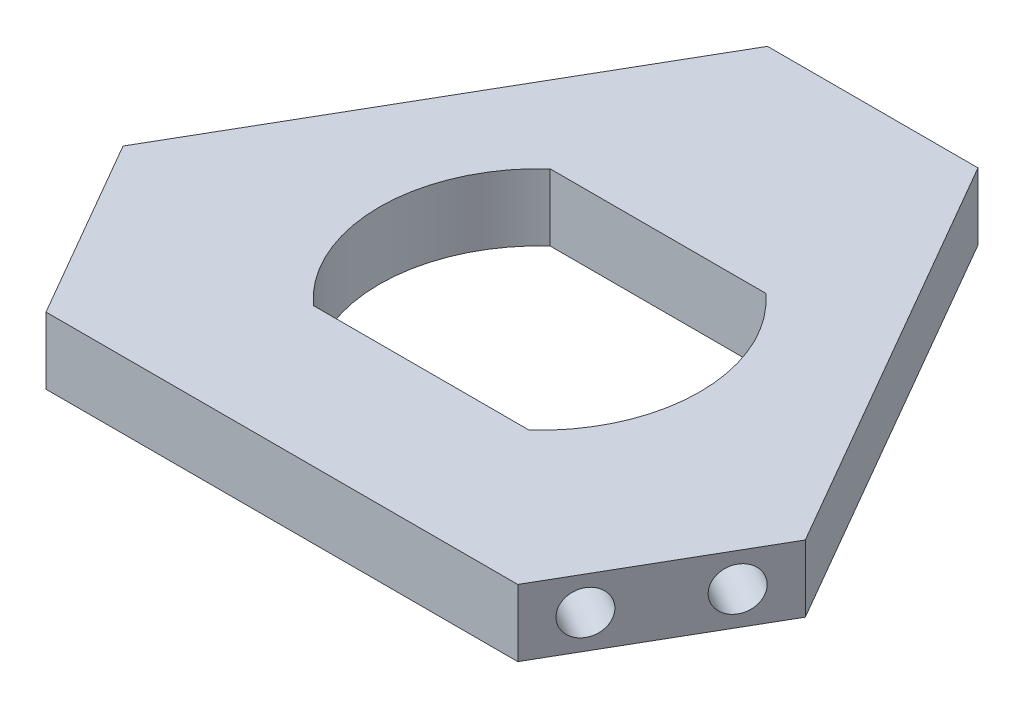
ISO-10303-21;
HEADER;
FILE_DESCRIPTION(('STEP AP214'),'2;1');
FILE_NAME('part.step','',(''),(''),'','','');
FILE_SCHEMA(('AUTOMOTIVE_DESIGN { 1 0 10303 214 1 1 1 1 }'));
ENDSEC;
DATA;
#1=APPLICATION_CONTEXT('core data for automotive mechanical design processes');
#2=APPLICATION_PROTOCOL_DEFINITION('international standard','automotive_design',2000,#1);
#3=PRODUCT_CONTEXT('',#1,'mechanical');
#4=PRODUCT('Part','Part','',(#3));
#5=PRODUCT_RELATED_PRODUCT_CATEGORY('part','',(#4));
#6=PRODUCT_DEFINITION_FORMATION('','',#4);
#7=PRODUCT_DEFINITION_CONTEXT('part definition',#1,'design');
#8=PRODUCT_DEFINITION('design','',#6,#7);
#9=PRODUCT_DEFINITION_SHAPE('','',#8);
#10=(LENGTH_UNIT() NAMED_UNIT(*) SI_UNIT(.MILLI.,.METRE.));
#11=(NAMED_UNIT(*) PLANE_ANGLE_UNIT() SI_UNIT($,.RADIAN.));
#12=(NAMED_UNIT(*) SI_UNIT($,.STERADIAN.) SOLID_ANGLE_UNIT());
#13=UNCERTAINTY_MEASURE_WITH_UNIT(LENGTH_MEASURE(1.E-05),#10,'distance_accuracy_value','');
#14=(GEOMETRIC_REPRESENTATION_CONTEXT(3) GLOBAL_UNCERTAINTY_ASSIGNED_CONTEXT((#13)) GLOBAL_UNIT_ASSIGNED_CONTEXT((#10,
#11,#12)) REPRESENTATION_CONTEXT('',''));
#15=CARTESIAN_POINT('',(0.,0.,0.));
#16=DIRECTION('',(0.,0.,1.));
#17=DIRECTION('',(1.,0.,0.));
#18=AXIS2_PLACEMENT_3D('',#15,#16,#17);
#19=CARTESIAN_POINT('',(0.,12.,0.));
#20=DIRECTION('',(0.,1.,0.));
#21=DIRECTION('',(0.,0.,1.));
#22=AXIS2_PLACEMENT_3D('',#19,#20,#21);
#23=PLANE('',#22);
#24=DIRECTION('',(-0.5,0.,-0.866025403784439));
#25=VECTOR('',#24,1.);
#26=CARTESIAN_POINT('',(61.2205985041123,12.,13.5371870788978));
#27=LINE('',#26,#25);
#28=CARTESIAN_POINT('',(61.2205985041123,12.,13.5371870788978));
#29=VERTEX_POINT('',#28);
#30=CARTESIAN_POINT('',(18.8867513459482,12.,-59.7871870788977));
#31=VERTEX_POINT('',#30);
#32=EDGE_CURVE('E157',#29,#31,#27,.T.);
#33=ORIENTED_EDGE('',*,*,#32,.T.);
#34=DIRECTION('',(-1.,0.,0.));
#35=VECTOR('',#34,1.);
#36=CARTESIAN_POINT('',(18.8867513459482,12.,-59.7871870788977));
#37=LINE('',#36,#35);
#38=CARTESIAN_POINT('',(-18.8867513459483,12.,-59.7871870788977));
#39=VERTEX_POINT('',#38);
#40=EDGE_CURVE('E145',#31,#39,#37,.T.);
#41=ORIENTED_EDGE('',*,*,#40,.T.);
#42=DIRECTION('',(-0.5,0.,0.866025403784439));
#43=VECTOR('',#42,1.);
#44=CARTESIAN_POINT('',(-18.8867513459483,12.,-59.7871870788977));
#45=LINE('',#44,#43);
#46=CARTESIAN_POINT('',(-61.2205985041123,12.,13.5371870788977));
#47=VERTEX_POINT('',#46);
#48=EDGE_CURVE('E148',#39,#47,#45,.T.);
#49=ORIENTED_EDGE('',*,*,#48,.T.);
#50=DIRECTION('',(0.499999999999997,0.,0.86602540378444));
#51=VECTOR('',#50,1.);
#52=CARTESIAN_POINT('',(-61.2205985041123,12.,13.5371870788977));
#53=LINE('',#52,#51);
#54=CARTESIAN_POINT('',(-42.3338471581642,12.,46.25));
#55=VERTEX_POINT('',#54);
#56=EDGE_CURVE('E151',#47,#55,#53,.T.);
#57=ORIENTED_EDGE('',*,*,#56,.T.);
#58=DIRECTION('',(1.,0.,0.));
#59=VECTOR('',#58,1.);
#60=CARTESIAN_POINT('',(-42.3338471581642,12.,46.25));
#61=LINE('',#60,#59);
#62=CARTESIAN_POINT('',(42.3338471581641,12.,46.25));
#63=VERTEX_POINT('',#62);
#64=EDGE_CURVE('E153',#55,#63,#61,.T.);
#65=ORIENTED_EDGE('',*,*,#64,.T.);
#66=DIRECTION('',(0.5,0.,-0.866025403784439));
#67=VECTOR('',#66,1.);
#68=CARTESIAN_POINT('',(42.3338471581641,12.,46.25));
#69=LINE('',#68,#67);
#70=EDGE_CURVE('E155',#63,#29,#69,.T.);
#71=ORIENTED_EDGE('',*,*,#70,.T.);
#72=EDGE_LOOP('',(#33,#41,#49,#57,#65,#71));
#73=FACE_BOUND('',#72,.T.);
#74=DIRECTION('',(1.,0.,0.));
#75=VECTOR('',#74,1.);
#76=CARTESIAN_POINT('',(-28.75,12.,21.25));
#77=LINE('',#76,#75);
#78=CARTESIAN_POINT('',(-19.3649167310371,12.,21.25));
#79=VERTEX_POINT('',#78);
#80=CARTESIAN_POINT('',(19.3649167310371,12.,21.25));
#81=VERTEX_POINT('',#80);
#82=EDGE_CURVE('E114',#79,#81,#77,.T.);
#83=ORIENTED_EDGE('',*,*,#82,.F.);
#84=CARTESIAN_POINT('',(0.,12.,0.));
#85=DIRECTION('',(0.,1.,0.));
#86=DIRECTION('',(0.,0.,1.));
#87=AXIS2_PLACEMENT_3D('',#84,#85,#86);
#88=CIRCLE('',#87,28.75);
#89=CARTESIAN_POINT('',(-19.3649167310371,12.,-21.25));
#90=VERTEX_POINT('',#89);
#91=EDGE_CURVE('E127',#90,#79,#88,.T.);
#92=ORIENTED_EDGE('',*,*,#91,.F.);
#93=DIRECTION('',(-1.,0.,0.));
#94=VECTOR('',#93,1.);
#95=CARTESIAN_POINT('',(-28.75,12.,-21.25));
#96=LINE('',#95,#94);
#97=CARTESIAN_POINT('',(19.3649167310371,12.,-21.25));
#98=VERTEX_POINT('',#97);
#99=EDGE_CURVE('E50',#98,#90,#96,.T.);
#100=ORIENTED_EDGE('',*,*,#99,.F.);
#101=EDGE_CURVE('E57',#81,#98,#88,.T.);
#102=ORIENTED_EDGE('',*,*,#101,.F.);
#103=EDGE_LOOP('',(#83,#92,#100,#102));
#104=FACE_BOUND('',#103,.T.);
#105=ADVANCED_FACE('F35',(#73,#104),#23,.T.);
#106=CARTESIAN_POINT('',(0.,0.,0.));
#107=DIRECTION('',(0.,1.,0.));
#108=DIRECTION('',(0.,0.,1.));
#109=AXIS2_PLACEMENT_3D('',#106,#107,#108);
#110=PLANE('',#109);
#111=DIRECTION('',(0.5,0.,-0.866025403784439));
#112=VECTOR('',#111,1.);
#113=CARTESIAN_POINT('',(42.3338471581641,0.,46.25));
#114=LINE('',#113,#112);
#115=CARTESIAN_POINT('',(42.3338471581641,0.,46.25));
#116=VERTEX_POINT('',#115);
#117=CARTESIAN_POINT('',(61.2205985041123,0.,13.5371870788978));
#118=VERTEX_POINT('',#117);
#119=EDGE_CURVE('E168',#116,#118,#114,.T.);
#120=ORIENTED_EDGE('',*,*,#119,.F.);
#121=DIRECTION('',(1.,0.,0.));
#122=VECTOR('',#121,1.);
#123=CARTESIAN_POINT('',(-42.3338471581642,0.,46.25));
#124=LINE('',#123,#122);
#125=CARTESIAN_POINT('',(-42.3338471581642,0.,46.25));
#126=VERTEX_POINT('',#125);
#127=EDGE_CURVE('E166',#126,#116,#124,.T.);
#128=ORIENTED_EDGE('',*,*,#127,.F.);
#129=DIRECTION('',(0.499999999999997,0.,0.86602540378444));
#130=VECTOR('',#129,1.);
#131=CARTESIAN_POINT('',(-61.2205985041123,0.,13.5371870788977));
#132=LINE('',#131,#130);
#133=CARTESIAN_POINT('',(-61.2205985041123,0.,13.5371870788977));
#134=VERTEX_POINT('',#133);
#135=EDGE_CURVE('E164',#134,#126,#132,.T.);
#136=ORIENTED_EDGE('',*,*,#135,.F.);
#137=DIRECTION('',(-0.5,0.,0.866025403784439));
#138=VECTOR('',#137,1.);
#139=CARTESIAN_POINT('',(-18.8867513459483,0.,-59.7871870788977));
#140=LINE('',#139,#138);
#141=CARTESIAN_POINT('',(-18.8867513459483,0.,-59.7871870788977));
#142=VERTEX_POINT('',#141);
#143=EDGE_CURVE('E162',#142,#134,#140,.T.);
#144=ORIENTED_EDGE('',*,*,#143,.F.);
#145=DIRECTION('',(-1.,0.,0.));
#146=VECTOR('',#145,1.);
#147=CARTESIAN_POINT('',(18.8867513459482,0.,-59.7871870788977));
#148=LINE('',#147,#146);
#149=CARTESIAN_POINT('',(18.8867513459482,0.,-59.7871870788977));
#150=VERTEX_POINT('',#149);
#151=EDGE_CURVE('E121',#150,#142,#148,.T.);
#152=ORIENTED_EDGE('',*,*,#151,.F.);
#153=DIRECTION('',(-0.5,0.,-0.866025403784439));
#154=VECTOR('',#153,1.);
#155=CARTESIAN_POINT('',(61.2205985041123,0.,13.5371870788978));
#156=LINE('',#155,#154);
#157=EDGE_CURVE('E149',#118,#150,#156,.T.);
#158=ORIENTED_EDGE('',*,*,#157,.F.);
#159=EDGE_LOOP('',(#120,#128,#136,#144,#152,#158));
#160=FACE_BOUND('',#159,.T.);
#161=DIRECTION('',(1.,0.,0.));
#162=VECTOR('',#161,1.);
#163=CARTESIAN_POINT('',(-28.75,0.,21.25));
#164=LINE('',#163,#162);
#165=CARTESIAN_POINT('',(-19.3649167310371,0.,21.25));
#166=VERTEX_POINT('',#165);
#167=CARTESIAN_POINT('',(19.3649167310371,0.,21.25));
#168=VERTEX_POINT('',#167);
#169=EDGE_CURVE('E140',#166,#168,#164,.T.);
#170=ORIENTED_EDGE('',*,*,#169,.T.);
#171=CARTESIAN_POINT('',(0.,0.,0.));
#172=DIRECTION('',(0.,1.,0.));
#173=DIRECTION('',(0.,0.,1.));
#174=AXIS2_PLACEMENT_3D('',#171,#172,#173);
#175=CIRCLE('',#174,28.75);
#176=CARTESIAN_POINT('',(19.3649167310371,0.,-21.25));
#177=VERTEX_POINT('',#176);
#178=EDGE_CURVE('E125',#168,#177,#175,.T.);
#179=ORIENTED_EDGE('',*,*,#178,.T.);
#180=DIRECTION('',(-1.,0.,0.));
#181=VECTOR('',#180,1.);
#182=CARTESIAN_POINT('',(-28.75,0.,-21.25));
#183=LINE('',#182,#181);
#184=CARTESIAN_POINT('',(-19.3649167310371,0.,-21.25));
#185=VERTEX_POINT('',#184);
#186=EDGE_CURVE('E139',#177,#185,#183,.T.);
#187=ORIENTED_EDGE('',*,*,#186,.T.);
#188=EDGE_CURVE('E135',#185,#166,#175,.T.);
#189=ORIENTED_EDGE('',*,*,#188,.T.);
#190=EDGE_LOOP('',(#170,#179,#187,#189));
#191=FACE_BOUND('',#190,.T.);
#192=ADVANCED_FACE('F192',(#160,#191),#110,.F.);
#193=CARTESIAN_POINT('',(18.8867513459482,12.,-59.7871870788977));
#194=DIRECTION('',(0.,0.,1.));
#195=DIRECTION('',(1.,0.,0.));
#196=AXIS2_PLACEMENT_3D('',#193,#194,#195);
#197=PLANE('',#196);
#198=CARTESIAN_POINT('',(9.9999999999997,6.,-59.7871870788978));
#199=DIRECTION('',(0.,0.,-1.));
#200=DIRECTION('',(-1.,0.,0.));
#201=AXIS2_PLACEMENT_3D('',#198,#199,#200);
#202=CIRCLE('',#201,3.875);
#203=CARTESIAN_POINT('',(6.12499999999971,6.,-59.7871870788978));
#204=VERTEX_POINT('',#203);
#205=EDGE_CURVE('E444',#204,#204,#202,.T.);
#206=ORIENTED_EDGE('',*,*,#205,.F.);
#207=EDGE_LOOP('',(#206));
#208=FACE_BOUND('',#207,.T.);
#209=CARTESIAN_POINT('',(-10.0000000000003,6.,-59.7871870788977));
#210=DIRECTION('',(0.,0.,-1.));
#211=DIRECTION('',(-1.,0.,0.));
#212=AXIS2_PLACEMENT_3D('',#209,#210,#211);
#213=CIRCLE('',#212,3.875);
#214=CARTESIAN_POINT('',(-13.8750000000003,6.,-59.7871870788977));
#215=VERTEX_POINT('',#214);
#216=EDGE_CURVE('E454',#215,#215,#213,.T.);
#217=ORIENTED_EDGE('',*,*,#216,.F.);
#218=EDGE_LOOP('',(#217));
#219=FACE_BOUND('',#218,.T.);
#220=ORIENTED_EDGE('',*,*,#151,.T.);
#221=DIRECTION('',(0.,-1.,0.));
#222=VECTOR('',#221,1.);
#223=CARTESIAN_POINT('',(-18.8867513459483,12.,-59.7871870788977));
#224=LINE('',#223,#222);
#225=EDGE_CURVE('E185',#39,#142,#224,.T.);
#226=ORIENTED_EDGE('',*,*,#225,.F.);
#227=ORIENTED_EDGE('',*,*,#40,.F.);
#228=DIRECTION('',(0.,-1.,0.));
#229=VECTOR('',#228,1.);
#230=CARTESIAN_POINT('',(18.8867513459482,12.,-59.7871870788977));
#231=LINE('',#230,#229);
#232=EDGE_CURVE('E159',#31,#150,#231,.T.);
#233=ORIENTED_EDGE('',*,*,#232,.T.);
#234=EDGE_LOOP('',(#220,#226,#227,#233));
#235=FACE_BOUND('',#234,.T.);
#236=ADVANCED_FACE('F37',(#208,#219,#235),#197,.F.);
#237=CARTESIAN_POINT('',(-18.8867513459483,12.,-59.7871870788977));
#238=DIRECTION('',(0.866025403784439,0.,0.5));
#239=DIRECTION('',(0.5,0.,-0.866025403784439));
#240=AXIS2_PLACEMENT_3D('',#237,#238,#239);
#241=PLANE('',#240);
#242=ORIENTED_EDGE('',*,*,#143,.T.);
#243=DIRECTION('',(0.,-1.,0.));
#244=VECTOR('',#243,1.);
#245=CARTESIAN_POINT('',(-61.2205985041123,12.,13.5371870788977));
#246=LINE('',#245,#244);
#247=EDGE_CURVE('E182',#47,#134,#246,.T.);
#248=ORIENTED_EDGE('',*,*,#247,.F.);
#249=ORIENTED_EDGE('',*,*,#48,.F.);
#250=ORIENTED_EDGE('',*,*,#225,.T.);
#251=EDGE_LOOP('',(#242,#248,#249,#250));
#252=FACE_BOUND('',#251,.T.);
#253=ADVANCED_FACE('F201',(#252),#241,.F.);
#254=CARTESIAN_POINT('',(-61.2205985041123,12.,13.5371870788977));
#255=DIRECTION('',(0.86602540378444,0.,-0.499999999999997));
#256=DIRECTION('',(-0.499999999999997,0.,-0.86602540378444));
#257=AXIS2_PLACEMENT_3D('',#254,#255,#256);
#258=PLANE('',#257);
#259=CARTESIAN_POINT('',(-56.777222831138,6.,21.233339501605));
#260=DIRECTION('',(-0.866025403784434,0.,0.500000000000008));
#261=DIRECTION('',(0.500000000000008,0.,0.866025403784434));
#262=AXIS2_PLACEMENT_3D('',#259,#260,#261);
#263=CIRCLE('',#262,3.875);
#264=CARTESIAN_POINT('',(-54.839722831138,6.,24.5891879412697));
#265=VERTEX_POINT('',#264);
#266=EDGE_CURVE('E460',#265,#265,#263,.T.);
#267=ORIENTED_EDGE('',*,*,#266,.F.);
#268=EDGE_LOOP('',(#267));
#269=FACE_BOUND('',#268,.T.);
#270=CARTESIAN_POINT('',(-46.7772228311378,6.,38.5538475772937));
#271=DIRECTION('',(-0.866025403784434,0.,0.500000000000008));
#272=DIRECTION('',(0.500000000000008,0.,0.866025403784434));
#273=AXIS2_PLACEMENT_3D('',#270,#271,#272);
#274=CIRCLE('',#273,3.875);
#275=CARTESIAN_POINT('',(-44.8397228311378,6.,41.9096960169584));
#276=VERTEX_POINT('',#275);
#277=EDGE_CURVE('E466',#276,#276,#274,.T.);
#278=ORIENTED_EDGE('',*,*,#277,.F.);
#279=EDGE_LOOP('',(#278));
#280=FACE_BOUND('',#279,.T.);
#281=ORIENTED_EDGE('',*,*,#135,.T.);
#282=DIRECTION('',(0.,-1.,0.));
#283=VECTOR('',#282,1.);
#284=CARTESIAN_POINT('',(-42.3338471581642,12.,46.25));
#285=LINE('',#284,#283);
#286=EDGE_CURVE('E179',#55,#126,#285,.T.);
#287=ORIENTED_EDGE('',*,*,#286,.F.);
#288=ORIENTED_EDGE('',*,*,#56,.F.);
#289=ORIENTED_EDGE('',*,*,#247,.T.);
#290=EDGE_LOOP('',(#281,#287,#288,#289));
#291=FACE_BOUND('',#290,.T.);
#292=ADVANCED_FACE('F219',(#269,#280,#291),#258,.F.);
#293=CARTESIAN_POINT('',(-42.3338471581642,12.,46.25));
#294=DIRECTION('',(0.,0.,-1.));
#295=DIRECTION('',(-1.,0.,0.));
#296=AXIS2_PLACEMENT_3D('',#293,#294,#295);
#297=PLANE('',#296);
#298=ORIENTED_EDGE('',*,*,#127,.T.);
#299=DIRECTION('',(0.,-1.,0.));
#300=VECTOR('',#299,1.);
#301=CARTESIAN_POINT('',(42.3338471581641,12.,46.25));
#302=LINE('',#301,#300);
#303=EDGE_CURVE('E176',#63,#116,#302,.T.);
#304=ORIENTED_EDGE('',*,*,#303,.F.);
#305=ORIENTED_EDGE('',*,*,#64,.F.);
#306=ORIENTED_EDGE('',*,*,#286,.T.);
#307=EDGE_LOOP('',(#298,#304,#305,#306));
#308=FACE_BOUND('',#307,.T.);
#309=ADVANCED_FACE('F215',(#308),#297,.F.);
#310=CARTESIAN_POINT('',(42.3338471581641,12.,46.25));
#311=DIRECTION('',(-0.866025403784439,0.,-0.5));
#312=DIRECTION('',(-0.5,0.,0.866025403784439));
#313=AXIS2_PLACEMENT_3D('',#310,#311,#312);
#314=PLANE('',#313);
#315=CARTESIAN_POINT('',(46.7772228311382,6.,38.5538475772932));
#316=DIRECTION('',(0.866025403784439,0.,0.5));
#317=DIRECTION('',(0.5,0.,-0.866025403784439));
#318=AXIS2_PLACEMENT_3D('',#315,#316,#317);
#319=CIRCLE('',#318,3.875);
#320=CARTESIAN_POINT('',(48.7147228311382,6.,35.1979991376285));
#321=VERTEX_POINT('',#320);
#322=EDGE_CURVE('E471',#321,#321,#319,.T.);
#323=ORIENTED_EDGE('',*,*,#322,.F.);
#324=EDGE_LOOP('',(#323));
#325=FACE_BOUND('',#324,.T.);
#326=CARTESIAN_POINT('',(56.7772228311382,6.,21.2333395016045));
#327=DIRECTION('',(0.866025403784439,0.,0.5));
#328=DIRECTION('',(0.5,0.,-0.866025403784439));
#329=AXIS2_PLACEMENT_3D('',#326,#327,#328);
#330=CIRCLE('',#329,3.875);
#331=CARTESIAN_POINT('',(58.7147228311382,6.,17.8774910619398));
#332=VERTEX_POINT('',#331);
#333=EDGE_CURVE('E133',#332,#332,#330,.T.);
#334=ORIENTED_EDGE('',*,*,#333,.F.);
#335=EDGE_LOOP('',(#334));
#336=FACE_BOUND('',#335,.T.);
#337=ORIENTED_EDGE('',*,*,#119,.T.);
#338=DIRECTION('',(0.,-1.,0.));
#339=VECTOR('',#338,1.);
#340=CARTESIAN_POINT('',(61.2205985041123,12.,13.5371870788978));
#341=LINE('',#340,#339);
#342=EDGE_CURVE('E173',#29,#118,#341,.T.);
#343=ORIENTED_EDGE('',*,*,#342,.F.);
#344=ORIENTED_EDGE('',*,*,#70,.F.);
#345=ORIENTED_EDGE('',*,*,#303,.T.);
#346=EDGE_LOOP('',(#337,#343,#344,#345));
#347=FACE_BOUND('',#346,.T.);
#348=ADVANCED_FACE('F211',(#325,#336,#347),#314,.F.);
#349=CARTESIAN_POINT('',(61.2205985041123,12.,13.5371870788978));
#350=DIRECTION('',(-0.866025403784438,0.,0.5));
#351=DIRECTION('',(0.5,0.,0.866025403784439));
#352=AXIS2_PLACEMENT_3D('',#349,#350,#351);
#353=PLANE('',#352);
#354=ORIENTED_EDGE('',*,*,#157,.T.);
#355=ORIENTED_EDGE('',*,*,#232,.F.);
#356=ORIENTED_EDGE('',*,*,#32,.F.);
#357=ORIENTED_EDGE('',*,*,#342,.T.);
#358=EDGE_LOOP('',(#354,#355,#356,#357));
#359=FACE_BOUND('',#358,.T.);
#360=ADVANCED_FACE('F208',(#359),#353,.F.);
#361=CARTESIAN_POINT('',(-28.75,12.,-21.25));
#362=DIRECTION('',(0.,0.,1.));
#363=DIRECTION('',(1.,0.,0.));
#364=AXIS2_PLACEMENT_3D('',#361,#362,#363);
#365=PLANE('',#364);
#366=DIRECTION('',(0.,-1.,0.));
#367=VECTOR('',#366,1.);
#368=CARTESIAN_POINT('',(-19.3649167310371,12.,-21.25));
#369=LINE('',#368,#367);
#370=EDGE_CURVE('E129',#185,#90,#369,.F.);
#371=ORIENTED_EDGE('',*,*,#370,.F.);
#372=ORIENTED_EDGE('',*,*,#186,.F.);
#373=DIRECTION('',(0.,-1.,0.));
#374=VECTOR('',#373,1.);
#375=CARTESIAN_POINT('',(19.3649167310371,12.,-21.25));
#376=LINE('',#375,#374);
#377=EDGE_CURVE('E126',#98,#177,#376,.T.);
#378=ORIENTED_EDGE('',*,*,#377,.F.);
#379=ORIENTED_EDGE('',*,*,#99,.T.);
#380=EDGE_LOOP('',(#371,#372,#378,#379));
#381=FACE_BOUND('',#380,.T.);
#382=ADVANCED_FACE('F190',(#381),#365,.T.);
#383=CARTESIAN_POINT('',(-28.75,12.,21.25));
#384=DIRECTION('',(0.,0.,-1.));
#385=DIRECTION('',(-1.,0.,0.));
#386=AXIS2_PLACEMENT_3D('',#383,#384,#385);
#387=PLANE('',#386);
#388=DIRECTION('',(0.,-1.,0.));
#389=VECTOR('',#388,1.);
#390=CARTESIAN_POINT('',(19.3649167310371,12.,21.25));
#391=LINE('',#390,#389);
#392=EDGE_CURVE('E11',#168,#81,#391,.F.);
#393=ORIENTED_EDGE('',*,*,#392,.F.);
#394=ORIENTED_EDGE('',*,*,#169,.F.);
#395=DIRECTION('',(0.,-1.,0.));
#396=VECTOR('',#395,1.);
#397=CARTESIAN_POINT('',(-19.3649167310371,12.,21.25));
#398=LINE('',#397,#396);
#399=EDGE_CURVE('E43',#79,#166,#398,.T.);
#400=ORIENTED_EDGE('',*,*,#399,.F.);
#401=ORIENTED_EDGE('',*,*,#82,.T.);
#402=EDGE_LOOP('',(#393,#394,#400,#401));
#403=FACE_BOUND('',#402,.T.);
#404=ADVANCED_FACE('F115',(#403),#387,.T.);
#405=CARTESIAN_POINT('',(0.,12.,0.));
#406=DIRECTION('',(0.,-1.,0.));
#407=DIRECTION('',(0.,0.,-1.));
#408=AXIS2_PLACEMENT_3D('',#405,#406,#407);
#409=CYLINDRICAL_SURFACE('',#408,28.75);
#410=ORIENTED_EDGE('',*,*,#188,.F.);
#411=ORIENTED_EDGE('',*,*,#370,.T.);
#412=ORIENTED_EDGE('',*,*,#91,.T.);
#413=ORIENTED_EDGE('',*,*,#399,.T.);
#414=EDGE_LOOP('',(#410,#411,#412,#413));
#415=FACE_BOUND('',#414,.T.);
#416=ADVANCED_FACE('F189',(#415),#409,.F.);
#417=ORIENTED_EDGE('',*,*,#101,.T.);
#418=ORIENTED_EDGE('',*,*,#377,.T.);
#419=ORIENTED_EDGE('',*,*,#178,.F.);
#420=ORIENTED_EDGE('',*,*,#392,.T.);
#421=EDGE_LOOP('',(#417,#418,#419,#420));
#422=FACE_BOUND('',#421,.T.);
#423=ADVANCED_FACE('F123',(#422),#409,.F.);
#424=CARTESIAN_POINT('',(48.1169687932938,6.,16.2333395016045));
#425=DIRECTION('',(0.866025403784439,0.,0.5));
#426=DIRECTION('',(0.5,0.,-0.866025403784439));
#427=AXIS2_PLACEMENT_3D('',#424,#425,#426);
#428=CYLINDRICAL_SURFACE('',#427,3.875);
#429=CARTESIAN_POINT('',(48.1169687932938,6.,16.2333395016045));
#430=DIRECTION('',(0.866025403784439,0.,0.5));
#431=DIRECTION('',(0.5,0.,-0.866025403784439));
#432=AXIS2_PLACEMENT_3D('',#429,#430,#431);
#433=CIRCLE('',#432,3.875);
#434=CARTESIAN_POINT('',(50.0544687932938,6.,12.8774910619398));
#435=VERTEX_POINT('',#434);
#436=EDGE_CURVE('E447',#435,#435,#433,.T.);
#437=ORIENTED_EDGE('',*,*,#436,.F.);
#438=EDGE_LOOP('',(#437));
#439=FACE_BOUND('',#438,.T.);
#440=ORIENTED_EDGE('',*,*,#333,.T.);
#441=EDGE_LOOP('',(#440));
#442=FACE_BOUND('',#441,.T.);
#443=ADVANCED_FACE('F292',(#439,#442),#428,.F.);
#444=CARTESIAN_POINT('',(48.1169687932938,6.,16.2333395016045));
#445=DIRECTION('',(0.866025403784439,0.,0.5));
#446=DIRECTION('',(0.5,0.,-0.866025403784439));
#447=AXIS2_PLACEMENT_3D('',#444,#445,#446);
#448=PLANE('',#447);
#449=ORIENTED_EDGE('',*,*,#436,.T.);
#450=EDGE_LOOP('',(#449));
#451=FACE_BOUND('',#450,.T.);
#452=ADVANCED_FACE('F297',(#451),#448,.T.);
#453=CARTESIAN_POINT('',(38.1169687932938,6.,33.5538475772932));
#454=DIRECTION('',(0.866025403784439,0.,0.5));
#455=DIRECTION('',(0.5,0.,-0.866025403784439));
#456=AXIS2_PLACEMENT_3D('',#453,#454,#455);
#457=CYLINDRICAL_SURFACE('',#456,3.875);
#458=CARTESIAN_POINT('',(38.1169687932938,6.,33.5538475772932));
#459=DIRECTION('',(0.866025403784439,0.,0.5));
#460=DIRECTION('',(0.5,0.,-0.866025403784439));
#461=AXIS2_PLACEMENT_3D('',#458,#459,#460);
#462=CIRCLE('',#461,3.875);
#463=CARTESIAN_POINT('',(40.0544687932938,6.,30.1979991376285));
#464=VERTEX_POINT('',#463);
#465=EDGE_CURVE('E136',#464,#464,#462,.T.);
#466=ORIENTED_EDGE('',*,*,#465,.F.);
#467=EDGE_LOOP('',(#466));
#468=FACE_BOUND('',#467,.T.);
#469=ORIENTED_EDGE('',*,*,#322,.T.);
#470=EDGE_LOOP('',(#469));
#471=FACE_BOUND('',#470,.T.);
#472=ADVANCED_FACE('F305',(#468,#471),#457,.F.);
#473=CARTESIAN_POINT('',(38.1169687932938,6.,33.5538475772932));
#474=DIRECTION('',(0.866025403784439,0.,0.5));
#475=DIRECTION('',(0.5,0.,-0.866025403784439));
#476=AXIS2_PLACEMENT_3D('',#473,#474,#475);
#477=PLANE('',#476);
#478=ORIENTED_EDGE('',*,*,#465,.T.);
#479=EDGE_LOOP('',(#478));
#480=FACE_BOUND('',#479,.T.);
#481=ADVANCED_FACE('F313',(#480),#477,.T.);
#482=CARTESIAN_POINT('',(-38.1169687932935,6.,33.5538475772936));
#483=DIRECTION('',(-0.866025403784434,0.,0.500000000000008));
#484=DIRECTION('',(0.500000000000008,0.,0.866025403784434));
#485=AXIS2_PLACEMENT_3D('',#482,#483,#484);
#486=CYLINDRICAL_SURFACE('',#485,3.875);
#487=CARTESIAN_POINT('',(-38.1169687932935,6.,33.5538475772936));
#488=DIRECTION('',(-0.866025403784434,0.,0.500000000000008));
#489=DIRECTION('',(0.500000000000008,0.,0.866025403784434));
#490=AXIS2_PLACEMENT_3D('',#487,#488,#489);
#491=CIRCLE('',#490,3.875);
#492=CARTESIAN_POINT('',(-36.1794687932935,6.,36.9096960169583));
#493=VERTEX_POINT('',#492);
#494=EDGE_CURVE('E463',#493,#493,#491,.T.);
#495=ORIENTED_EDGE('',*,*,#494,.F.);
#496=EDGE_LOOP('',(#495));
#497=FACE_BOUND('',#496,.T.);
#498=ORIENTED_EDGE('',*,*,#277,.T.);
#499=EDGE_LOOP('',(#498));
#500=FACE_BOUND('',#499,.T.);
#501=ADVANCED_FACE('F321',(#497,#500),#486,.F.);
#502=CARTESIAN_POINT('',(-38.1169687932935,6.,33.5538475772936));
#503=DIRECTION('',(-0.866025403784434,0.,0.500000000000008));
#504=DIRECTION('',(0.500000000000008,0.,0.866025403784434));
#505=AXIS2_PLACEMENT_3D('',#502,#503,#504);
#506=PLANE('',#505);
#507=ORIENTED_EDGE('',*,*,#494,.T.);
#508=EDGE_LOOP('',(#507));
#509=FACE_BOUND('',#508,.T.);
#510=ADVANCED_FACE('F328',(#509),#506,.T.);
#511=CARTESIAN_POINT('',(-48.1169687932937,6.,16.233339501605));
#512=DIRECTION('',(-0.866025403784434,0.,0.500000000000008));
#513=DIRECTION('',(0.500000000000008,0.,0.866025403784434));
#514=AXIS2_PLACEMENT_3D('',#511,#512,#513);
#515=CYLINDRICAL_SURFACE('',#514,3.875);
#516=CARTESIAN_POINT('',(-48.1169687932937,6.,16.233339501605));
#517=DIRECTION('',(-0.866025403784434,0.,0.500000000000008));
#518=DIRECTION('',(0.500000000000008,0.,0.866025403784434));
#519=AXIS2_PLACEMENT_3D('',#516,#517,#518);
#520=CIRCLE('',#519,3.875);
#521=CARTESIAN_POINT('',(-46.1794687932936,6.,19.5891879412696));
#522=VERTEX_POINT('',#521);
#523=EDGE_CURVE('E457',#522,#522,#520,.T.);
#524=ORIENTED_EDGE('',*,*,#523,.F.);
#525=EDGE_LOOP('',(#524));
#526=FACE_BOUND('',#525,.T.);
#527=ORIENTED_EDGE('',*,*,#266,.T.);
#528=EDGE_LOOP('',(#527));
#529=FACE_BOUND('',#528,.T.);
#530=ADVANCED_FACE('F336',(#526,#529),#515,.F.);
#531=CARTESIAN_POINT('',(-48.1169687932937,6.,16.233339501605));
#532=DIRECTION('',(-0.866025403784434,0.,0.500000000000008));
#533=DIRECTION('',(0.500000000000008,0.,0.866025403784434));
#534=AXIS2_PLACEMENT_3D('',#531,#532,#533);
#535=PLANE('',#534);
#536=ORIENTED_EDGE('',*,*,#523,.T.);
#537=EDGE_LOOP('',(#536));
#538=FACE_BOUND('',#537,.T.);
#539=ADVANCED_FACE('F344',(#538),#535,.T.);
#540=CARTESIAN_POINT('',(-10.0000000000002,6.,-49.7871870788977));
#541=DIRECTION('',(0.,0.,-1.));
#542=DIRECTION('',(-1.,0.,0.));
#543=AXIS2_PLACEMENT_3D('',#540,#541,#542);
#544=CYLINDRICAL_SURFACE('',#543,3.875);
#545=CARTESIAN_POINT('',(-10.0000000000002,6.,-49.7871870788977));
#546=DIRECTION('',(0.,0.,-1.));
#547=DIRECTION('',(-1.,0.,0.));
#548=AXIS2_PLACEMENT_3D('',#545,#546,#547);
#549=CIRCLE('',#548,3.875);
#550=CARTESIAN_POINT('',(-13.8750000000002,6.,-49.7871870788977));
#551=VERTEX_POINT('',#550);
#552=EDGE_CURVE('E449',#551,#551,#549,.T.);
#553=ORIENTED_EDGE('',*,*,#552,.F.);
#554=EDGE_LOOP('',(#553));
#555=FACE_BOUND('',#554,.T.);
#556=ORIENTED_EDGE('',*,*,#216,.T.);
#557=EDGE_LOOP('',(#556));
#558=FACE_BOUND('',#557,.T.);
#559=ADVANCED_FACE('F352',(#555,#558),#544,.F.);
#560=CARTESIAN_POINT('',(-10.0000000000002,6.,-49.7871870788977));
#561=DIRECTION('',(0.,0.,-1.));
#562=DIRECTION('',(-1.,0.,0.));
#563=AXIS2_PLACEMENT_3D('',#560,#561,#562);
#564=PLANE('',#563);
#565=ORIENTED_EDGE('',*,*,#552,.T.);
#566=EDGE_LOOP('',(#565));
#567=FACE_BOUND('',#566,.T.);
#568=ADVANCED_FACE('F360',(#567),#564,.T.);
#569=CARTESIAN_POINT('',(9.99999999999975,6.,-49.7871870788978));
#570=DIRECTION('',(0.,0.,-1.));
#571=DIRECTION('',(-1.,0.,0.));
#572=AXIS2_PLACEMENT_3D('',#569,#570,#571);
#573=CYLINDRICAL_SURFACE('',#572,3.875);
#574=CARTESIAN_POINT('',(9.99999999999975,6.,-49.7871870788978));
#575=DIRECTION('',(0.,0.,-1.));
#576=DIRECTION('',(-1.,0.,0.));
#577=AXIS2_PLACEMENT_3D('',#574,#575,#576);
#578=CIRCLE('',#577,3.875);
#579=CARTESIAN_POINT('',(6.12499999999975,6.,-49.7871870788978));
#580=VERTEX_POINT('',#579);
#581=EDGE_CURVE('E443',#580,#580,#578,.T.);
#582=ORIENTED_EDGE('',*,*,#581,.F.);
#583=EDGE_LOOP('',(#582));
#584=FACE_BOUND('',#583,.T.);
#585=ORIENTED_EDGE('',*,*,#205,.T.);
#586=EDGE_LOOP('',(#585));
#587=FACE_BOUND('',#586,.T.);
#588=ADVANCED_FACE('F368',(#584,#587),#573,.F.);
#589=CARTESIAN_POINT('',(9.99999999999975,6.,-49.7871870788978));
#590=DIRECTION('',(0.,0.,-1.));
#591=DIRECTION('',(-1.,0.,0.));
#592=AXIS2_PLACEMENT_3D('',#589,#590,#591);
#593=PLANE('',#592);
#594=ORIENTED_EDGE('',*,*,#581,.T.);
#595=EDGE_LOOP('',(#594));
#596=FACE_BOUND('',#595,.T.);
#597=ADVANCED_FACE('F376',(#596),#593,.T.);
#598=CLOSED_SHELL('',(#105,#192,#236,#253,#292,#309,#348,#360,#382,#404,#416,#423,#443,#452,
#472,#481,#501,#510,#530,#539,#559,#568,#588,#597));
#599=MANIFOLD_SOLID_BREP('B2',#598);
#600=ADVANCED_BREP_SHAPE_REPRESENTATION('',(#18,#599),#14);
#601=SHAPE_DEFINITION_REPRESENTATION(#9,#600);
ENDSEC;
END-ISO-10303-21;
